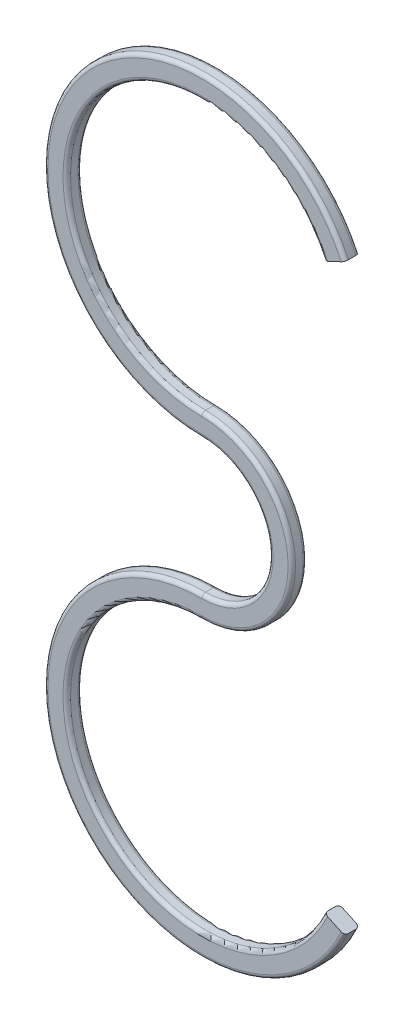
ISO-10303-21;
HEADER;
FILE_DESCRIPTION(('STEP AP214'),'2;1');
FILE_NAME('part.step','',(''),(''),'','','');
FILE_SCHEMA(('AUTOMOTIVE_DESIGN { 1 0 10303 214 1 1 1 1 }'));
ENDSEC;
DATA;
#1=APPLICATION_CONTEXT('core data for automotive mechanical design processes');
#2=APPLICATION_PROTOCOL_DEFINITION('international standard','automotive_design',2000,#1);
#3=PRODUCT_CONTEXT('',#1,'mechanical');
#4=PRODUCT('Part','Part','',(#3));
#5=PRODUCT_RELATED_PRODUCT_CATEGORY('part','',(#4));
#6=PRODUCT_DEFINITION_FORMATION('','',#4);
#7=PRODUCT_DEFINITION_CONTEXT('part definition',#1,'design');
#8=PRODUCT_DEFINITION('design','',#6,#7);
#9=PRODUCT_DEFINITION_SHAPE('','',#8);
#10=(LENGTH_UNIT() NAMED_UNIT(*) SI_UNIT(.MILLI.,.METRE.));
#11=(NAMED_UNIT(*) PLANE_ANGLE_UNIT() SI_UNIT($,.RADIAN.));
#12=(NAMED_UNIT(*) SI_UNIT($,.STERADIAN.) SOLID_ANGLE_UNIT());
#13=UNCERTAINTY_MEASURE_WITH_UNIT(LENGTH_MEASURE(1.E-05),#10,'distance_accuracy_value','');
#14=(GEOMETRIC_REPRESENTATION_CONTEXT(3) GLOBAL_UNCERTAINTY_ASSIGNED_CONTEXT((#13)) GLOBAL_UNIT_ASSIGNED_CONTEXT((#10,
#11,#12)) REPRESENTATION_CONTEXT('',''));
#15=CARTESIAN_POINT('',(0.,0.,0.));
#16=DIRECTION('',(0.,0.,1.));
#17=DIRECTION('',(1.,0.,0.));
#18=AXIS2_PLACEMENT_3D('',#15,#16,#17);
#19=CARTESIAN_POINT('',(0.,15.,1.));
#20=DIRECTION('',(0.,0.,-1.));
#21=DIRECTION('',(-1.,0.,0.));
#22=AXIS2_PLACEMENT_3D('',#19,#20,#21);
#23=CYLINDRICAL_SURFACE('',#22,9.);
#24=DIRECTION('',(0.,0.,-1.));
#25=VECTOR('',#24,1.);
#26=CARTESIAN_POINT('',(8.15677008332986,18.8035643556663,1.));
#27=LINE('',#26,#25);
#28=CARTESIAN_POINT('',(8.15677008332986,18.8035643556663,0.75));
#29=VERTEX_POINT('',#28);
#30=CARTESIAN_POINT('',(8.15677008332986,18.8035643556663,0.25));
#31=VERTEX_POINT('',#30);
#32=EDGE_CURVE('E302',#29,#31,#27,.T.);
#33=ORIENTED_EDGE('',*,*,#32,.F.);
#34=CARTESIAN_POINT('',(0.,15.,0.75));
#35=DIRECTION('',(0.,0.,-1.));
#36=DIRECTION('',(-1.,0.,0.));
#37=AXIS2_PLACEMENT_3D('',#34,#35,#36);
#38=CIRCLE('',#37,9.);
#39=CARTESIAN_POINT('',(0.,6.,0.75));
#40=VERTEX_POINT('',#39);
#41=EDGE_CURVE('E11',#29,#40,#38,.F.);
#42=ORIENTED_EDGE('',*,*,#41,.T.);
#43=DIRECTION('',(0.,0.,-1.));
#44=VECTOR('',#43,1.);
#45=CARTESIAN_POINT('',(0.,6.,1.));
#46=LINE('',#45,#44);
#47=CARTESIAN_POINT('',(0.,6.,0.25));
#48=VERTEX_POINT('',#47);
#49=EDGE_CURVE('E350',#40,#48,#46,.T.);
#50=ORIENTED_EDGE('',*,*,#49,.T.);
#51=CARTESIAN_POINT('',(0.,15.,0.25));
#52=DIRECTION('',(0.,0.,-1.));
#53=DIRECTION('',(-1.,0.,0.));
#54=AXIS2_PLACEMENT_3D('',#51,#52,#53);
#55=CIRCLE('',#54,9.);
#56=EDGE_CURVE('E55',#48,#31,#55,.T.);
#57=ORIENTED_EDGE('',*,*,#56,.T.);
#58=EDGE_LOOP('',(#33,#42,#50,#57));
#59=FACE_BOUND('',#58,.T.);
#60=ADVANCED_FACE('F45',(#59),#23,.F.);
#61=CARTESIAN_POINT('',(9.51623176388483,19.4374917482773,1.));
#62=DIRECTION('',(0.422618261740698,-0.906307787036651,0.));
#63=DIRECTION('',(0.906307787036651,0.422618261740698,0.));
#64=AXIS2_PLACEMENT_3D('',#61,#62,#63);
#65=PLANE('',#64);
#66=DIRECTION('',(-0.906307787036651,-0.422618261740698,0.));
#67=VECTOR('',#66,1.);
#68=CARTESIAN_POINT('',(9.51623176388483,19.4374917482773,0.));
#69=LINE('',#68,#67);
#70=CARTESIAN_POINT('',(9.28965481712567,19.3318371828422,0.));
#71=VERTEX_POINT('',#70);
#72=CARTESIAN_POINT('',(8.38334703008902,18.9092189211015,0.));
#73=VERTEX_POINT('',#72);
#74=EDGE_CURVE('E180',#71,#73,#69,.T.);
#75=ORIENTED_EDGE('',*,*,#74,.F.);
#76=CARTESIAN_POINT('',(9.28965481712567,19.3318371828422,0.25));
#77=DIRECTION('',(0.422618261740698,-0.906307787036651,0.));
#78=DIRECTION('',(0.906307787036651,0.422618261740698,0.));
#79=AXIS2_PLACEMENT_3D('',#76,#77,#78);
#80=CIRCLE('',#79,0.25);
#81=CARTESIAN_POINT('',(9.51623176388483,19.4374917482773,0.25));
#82=VERTEX_POINT('',#81);
#83=EDGE_CURVE('E329',#71,#82,#80,.T.);
#84=ORIENTED_EDGE('',*,*,#83,.T.);
#85=DIRECTION('',(0.,0.,-1.));
#86=VECTOR('',#85,1.);
#87=CARTESIAN_POINT('',(9.51623176388483,19.4374917482773,1.));
#88=LINE('',#87,#86);
#89=CARTESIAN_POINT('',(9.51623176388483,19.4374917482773,0.75));
#90=VERTEX_POINT('',#89);
#91=EDGE_CURVE('E298',#90,#82,#88,.T.);
#92=ORIENTED_EDGE('',*,*,#91,.F.);
#93=CARTESIAN_POINT('',(9.28965481712567,19.3318371828422,0.75));
#94=DIRECTION('',(0.422618261740698,-0.906307787036651,0.));
#95=DIRECTION('',(0.906307787036651,0.422618261740698,0.));
#96=AXIS2_PLACEMENT_3D('',#93,#94,#95);
#97=CIRCLE('',#96,0.25);
#98=CARTESIAN_POINT('',(9.28965481712567,19.3318371828422,1.));
#99=VERTEX_POINT('',#98);
#100=EDGE_CURVE('E326',#90,#99,#97,.T.);
#101=ORIENTED_EDGE('',*,*,#100,.T.);
#102=DIRECTION('',(-0.906307787036651,-0.422618261740698,0.));
#103=VECTOR('',#102,1.);
#104=CARTESIAN_POINT('',(9.51623176388483,19.4374917482773,1.));
#105=LINE('',#104,#103);
#106=CARTESIAN_POINT('',(8.38334703008902,18.9092189211015,1.));
#107=VERTEX_POINT('',#106);
#108=EDGE_CURVE('E179',#99,#107,#105,.T.);
#109=ORIENTED_EDGE('',*,*,#108,.T.);
#110=CARTESIAN_POINT('',(8.38334703008902,18.9092189211015,0.75));
#111=DIRECTION('',(0.422618261740698,-0.906307787036651,0.));
#112=DIRECTION('',(0.906307787036651,0.422618261740698,0.));
#113=AXIS2_PLACEMENT_3D('',#110,#111,#112);
#114=CIRCLE('',#113,0.25);
#115=EDGE_CURVE('E323',#107,#29,#114,.T.);
#116=ORIENTED_EDGE('',*,*,#115,.T.);
#117=ORIENTED_EDGE('',*,*,#32,.T.);
#118=CARTESIAN_POINT('',(8.38334703008902,18.9092189211015,0.25));
#119=DIRECTION('',(0.422618261740698,-0.906307787036651,0.));
#120=DIRECTION('',(0.906307787036651,0.422618261740698,0.));
#121=AXIS2_PLACEMENT_3D('',#118,#119,#120);
#122=CIRCLE('',#121,0.25);
#123=EDGE_CURVE('E320',#31,#73,#122,.T.);
#124=ORIENTED_EDGE('',*,*,#123,.T.);
#125=EDGE_LOOP('',(#75,#84,#92,#101,#109,#116,#117,#124));
#126=FACE_BOUND('',#125,.T.);
#127=ADVANCED_FACE('F393',(#126),#65,.T.);
#128=CARTESIAN_POINT('',(0.,15.,1.));
#129=DIRECTION('',(0.,0.,-1.));
#130=DIRECTION('',(-1.,0.,0.));
#131=AXIS2_PLACEMENT_3D('',#128,#129,#130);
#132=CYLINDRICAL_SURFACE('',#131,10.5);
#133=ORIENTED_EDGE('',*,*,#91,.T.);
#134=CARTESIAN_POINT('',(0.,15.,0.25));
#135=DIRECTION('',(0.,0.,-1.));
#136=DIRECTION('',(-1.,0.,0.));
#137=AXIS2_PLACEMENT_3D('',#134,#135,#136);
#138=CIRCLE('',#137,10.5);
#139=CARTESIAN_POINT('',(0.,4.5,0.25));
#140=VERTEX_POINT('',#139);
#141=EDGE_CURVE('E336',#82,#140,#138,.F.);
#142=ORIENTED_EDGE('',*,*,#141,.T.);
#143=DIRECTION('',(0.,0.,-1.));
#144=VECTOR('',#143,1.);
#145=CARTESIAN_POINT('',(0.,4.5,1.));
#146=LINE('',#145,#144);
#147=CARTESIAN_POINT('',(0.,4.5,0.75));
#148=VERTEX_POINT('',#147);
#149=EDGE_CURVE('E289',#148,#140,#146,.T.);
#150=ORIENTED_EDGE('',*,*,#149,.F.);
#151=CARTESIAN_POINT('',(0.,15.,0.75));
#152=DIRECTION('',(0.,0.,-1.));
#153=DIRECTION('',(-1.,0.,0.));
#154=AXIS2_PLACEMENT_3D('',#151,#152,#153);
#155=CIRCLE('',#154,10.5);
#156=EDGE_CURVE('E332',#148,#90,#155,.T.);
#157=ORIENTED_EDGE('',*,*,#156,.T.);
#158=EDGE_LOOP('',(#133,#142,#150,#157));
#159=FACE_BOUND('',#158,.T.);
#160=ADVANCED_FACE('F398',(#159),#132,.T.);
#161=CARTESIAN_POINT('',(0.,0.,1.));
#162=DIRECTION('',(0.,0.,-1.));
#163=DIRECTION('',(-1.,0.,0.));
#164=AXIS2_PLACEMENT_3D('',#161,#162,#163);
#165=CYLINDRICAL_SURFACE('',#164,4.5);
#166=ORIENTED_EDGE('',*,*,#149,.T.);
#167=CARTESIAN_POINT('',(0.,0.,0.25));
#168=DIRECTION('',(0.,0.,-1.));
#169=DIRECTION('',(-1.,0.,0.));
#170=AXIS2_PLACEMENT_3D('',#167,#168,#169);
#171=CIRCLE('',#170,4.5);
#172=CARTESIAN_POINT('',(0.,-4.5,0.25));
#173=VERTEX_POINT('',#172);
#174=EDGE_CURVE('E341',#140,#173,#171,.T.);
#175=ORIENTED_EDGE('',*,*,#174,.T.);
#176=DIRECTION('',(0.,0.,-1.));
#177=VECTOR('',#176,1.);
#178=CARTESIAN_POINT('',(0.,-4.5,1.));
#179=LINE('',#178,#177);
#180=CARTESIAN_POINT('',(0.,-4.5,0.75));
#181=VERTEX_POINT('',#180);
#182=EDGE_CURVE('E284',#181,#173,#179,.T.);
#183=ORIENTED_EDGE('',*,*,#182,.F.);
#184=CARTESIAN_POINT('',(0.,0.,0.75));
#185=DIRECTION('',(0.,0.,-1.));
#186=DIRECTION('',(-1.,0.,0.));
#187=AXIS2_PLACEMENT_3D('',#184,#185,#186);
#188=CIRCLE('',#187,4.5);
#189=EDGE_CURVE('E236',#181,#148,#188,.F.);
#190=ORIENTED_EDGE('',*,*,#189,.T.);
#191=EDGE_LOOP('',(#166,#175,#183,#190));
#192=FACE_BOUND('',#191,.T.);
#193=ADVANCED_FACE('F405',(#192),#165,.F.);
#194=CARTESIAN_POINT('',(0.,-15.,1.));
#195=DIRECTION('',(0.,0.,-1.));
#196=DIRECTION('',(-1.,0.,0.));
#197=AXIS2_PLACEMENT_3D('',#194,#195,#196);
#198=CYLINDRICAL_SURFACE('',#197,10.5);
#199=ORIENTED_EDGE('',*,*,#182,.T.);
#200=CARTESIAN_POINT('',(0.,-15.,0.25));
#201=DIRECTION('',(0.,0.,-1.));
#202=DIRECTION('',(-1.,0.,0.));
#203=AXIS2_PLACEMENT_3D('',#200,#201,#202);
#204=CIRCLE('',#203,10.5);
#205=CARTESIAN_POINT('',(9.51623176388483,-19.4374917482773,0.25));
#206=VERTEX_POINT('',#205);
#207=EDGE_CURVE('E272',#173,#206,#204,.F.);
#208=ORIENTED_EDGE('',*,*,#207,.T.);
#209=DIRECTION('',(0.,0.,-1.));
#210=VECTOR('',#209,1.);
#211=CARTESIAN_POINT('',(9.51623176388483,-19.4374917482773,1.));
#212=LINE('',#211,#210);
#213=CARTESIAN_POINT('',(9.51623176388483,-19.4374917482773,0.75));
#214=VERTEX_POINT('',#213);
#215=EDGE_CURVE('E276',#214,#206,#212,.T.);
#216=ORIENTED_EDGE('',*,*,#215,.F.);
#217=CARTESIAN_POINT('',(0.,-15.,0.75));
#218=DIRECTION('',(0.,0.,-1.));
#219=DIRECTION('',(-1.,0.,0.));
#220=AXIS2_PLACEMENT_3D('',#217,#218,#219);
#221=CIRCLE('',#220,10.5);
#222=EDGE_CURVE('E241',#214,#181,#221,.T.);
#223=ORIENTED_EDGE('',*,*,#222,.T.);
#224=EDGE_LOOP('',(#199,#208,#216,#223));
#225=FACE_BOUND('',#224,.T.);
#226=ADVANCED_FACE('F280',(#225),#198,.T.);
#227=CARTESIAN_POINT('',(8.15677008332986,-18.8035643556663,1.));
#228=DIRECTION('',(0.422618261740701,0.906307787036649,0.));
#229=DIRECTION('',(-0.906307787036649,0.422618261740701,0.));
#230=AXIS2_PLACEMENT_3D('',#227,#228,#229);
#231=PLANE('',#230);
#232=ORIENTED_EDGE('',*,*,#215,.T.);
#233=CARTESIAN_POINT('',(9.28965481712565,-19.3318371828422,0.25));
#234=DIRECTION('',(0.422618261740701,0.906307787036649,0.));
#235=DIRECTION('',(-0.906307787036649,0.422618261740701,0.));
#236=AXIS2_PLACEMENT_3D('',#233,#234,#235);
#237=CIRCLE('',#236,0.25);
#238=CARTESIAN_POINT('',(9.28965481712567,-19.3318371828422,0.));
#239=VERTEX_POINT('',#238);
#240=EDGE_CURVE('E177',#206,#239,#237,.T.);
#241=ORIENTED_EDGE('',*,*,#240,.T.);
#242=DIRECTION('',(0.906307787036649,-0.422618261740701,0.));
#243=VECTOR('',#242,1.);
#244=CARTESIAN_POINT('',(8.15677008332986,-18.8035643556663,0.));
#245=LINE('',#244,#243);
#246=CARTESIAN_POINT('',(8.38334703008902,-18.9092189211015,0.));
#247=VERTEX_POINT('',#246);
#248=EDGE_CURVE('E164',#247,#239,#245,.T.);
#249=ORIENTED_EDGE('',*,*,#248,.F.);
#250=CARTESIAN_POINT('',(8.38334703008901,-18.9092189211015,0.25));
#251=DIRECTION('',(0.422618261740701,0.906307787036649,0.));
#252=DIRECTION('',(-0.906307787036649,0.422618261740701,0.));
#253=AXIS2_PLACEMENT_3D('',#250,#251,#252);
#254=CIRCLE('',#253,0.25);
#255=CARTESIAN_POINT('',(8.15677008332986,-18.8035643556663,0.25));
#256=VERTEX_POINT('',#255);
#257=EDGE_CURVE('E63',#247,#256,#254,.T.);
#258=ORIENTED_EDGE('',*,*,#257,.T.);
#259=DIRECTION('',(0.,0.,-1.));
#260=VECTOR('',#259,1.);
#261=CARTESIAN_POINT('',(8.15677008332986,-18.8035643556663,1.));
#262=LINE('',#261,#260);
#263=CARTESIAN_POINT('',(8.15677008332986,-18.8035643556663,0.75));
#264=VERTEX_POINT('',#263);
#265=EDGE_CURVE('E285',#264,#256,#262,.T.);
#266=ORIENTED_EDGE('',*,*,#265,.F.);
#267=CARTESIAN_POINT('',(8.38334703008901,-18.9092189211015,0.75));
#268=DIRECTION('',(0.422618261740701,0.906307787036649,0.));
#269=DIRECTION('',(-0.906307787036649,0.422618261740701,0.));
#270=AXIS2_PLACEMENT_3D('',#267,#268,#269);
#271=CIRCLE('',#270,0.25);
#272=CARTESIAN_POINT('',(8.38334703008902,-18.9092189211015,1.));
#273=VERTEX_POINT('',#272);
#274=EDGE_CURVE('E186',#264,#273,#271,.T.);
#275=ORIENTED_EDGE('',*,*,#274,.T.);
#276=DIRECTION('',(0.906307787036649,-0.422618261740701,0.));
#277=VECTOR('',#276,1.);
#278=CARTESIAN_POINT('',(8.15677008332986,-18.8035643556663,1.));
#279=LINE('',#278,#277);
#280=CARTESIAN_POINT('',(9.28965481712567,-19.3318371828422,1.));
#281=VERTEX_POINT('',#280);
#282=EDGE_CURVE('E277',#273,#281,#279,.T.);
#283=ORIENTED_EDGE('',*,*,#282,.T.);
#284=CARTESIAN_POINT('',(9.28965481712565,-19.3318371828422,0.75));
#285=DIRECTION('',(0.422618261740701,0.906307787036649,0.));
#286=DIRECTION('',(-0.906307787036649,0.422618261740701,0.));
#287=AXIS2_PLACEMENT_3D('',#284,#285,#286);
#288=CIRCLE('',#287,0.25);
#289=EDGE_CURVE('E191',#281,#214,#288,.T.);
#290=ORIENTED_EDGE('',*,*,#289,.T.);
#291=EDGE_LOOP('',(#232,#241,#249,#258,#266,#275,#283,#290));
#292=FACE_BOUND('',#291,.T.);
#293=ADVANCED_FACE('F175',(#292),#231,.T.);
#294=CARTESIAN_POINT('',(0.,-15.,1.));
#295=DIRECTION('',(0.,0.,-1.));
#296=DIRECTION('',(-1.,0.,0.));
#297=AXIS2_PLACEMENT_3D('',#294,#295,#296);
#298=CYLINDRICAL_SURFACE('',#297,9.);
#299=ORIENTED_EDGE('',*,*,#265,.T.);
#300=CARTESIAN_POINT('',(0.,-15.,0.25));
#301=DIRECTION('',(0.,0.,-1.));
#302=DIRECTION('',(-1.,0.,0.));
#303=AXIS2_PLACEMENT_3D('',#300,#301,#302);
#304=CIRCLE('',#303,9.);
#305=CARTESIAN_POINT('',(0.,-6.,0.25));
#306=VERTEX_POINT('',#305);
#307=EDGE_CURVE('E184',#256,#306,#304,.T.);
#308=ORIENTED_EDGE('',*,*,#307,.T.);
#309=DIRECTION('',(0.,0.,-1.));
#310=VECTOR('',#309,1.);
#311=CARTESIAN_POINT('',(0.,-6.,1.));
#312=LINE('',#311,#310);
#313=CARTESIAN_POINT('',(0.,-6.,0.75));
#314=VERTEX_POINT('',#313);
#315=EDGE_CURVE('E291',#314,#306,#312,.T.);
#316=ORIENTED_EDGE('',*,*,#315,.F.);
#317=CARTESIAN_POINT('',(0.,-15.,0.75));
#318=DIRECTION('',(0.,0.,-1.));
#319=DIRECTION('',(-1.,0.,0.));
#320=AXIS2_PLACEMENT_3D('',#317,#318,#319);
#321=CIRCLE('',#320,9.);
#322=EDGE_CURVE('E70',#314,#264,#321,.F.);
#323=ORIENTED_EDGE('',*,*,#322,.T.);
#324=EDGE_LOOP('',(#299,#308,#316,#323));
#325=FACE_BOUND('',#324,.T.);
#326=ADVANCED_FACE('F353',(#325),#298,.F.);
#327=CARTESIAN_POINT('',(0.,0.,1.));
#328=DIRECTION('',(0.,0.,-1.));
#329=DIRECTION('',(-1.,0.,0.));
#330=AXIS2_PLACEMENT_3D('',#327,#328,#329);
#331=CYLINDRICAL_SURFACE('',#330,6.);
#332=ORIENTED_EDGE('',*,*,#315,.T.);
#333=CARTESIAN_POINT('',(0.,0.,0.25));
#334=DIRECTION('',(0.,0.,-1.));
#335=DIRECTION('',(-1.,0.,0.));
#336=AXIS2_PLACEMENT_3D('',#333,#334,#335);
#337=CIRCLE('',#336,6.);
#338=EDGE_CURVE('E247',#306,#48,#337,.F.);
#339=ORIENTED_EDGE('',*,*,#338,.T.);
#340=ORIENTED_EDGE('',*,*,#49,.F.);
#341=CARTESIAN_POINT('',(0.,0.,0.75));
#342=DIRECTION('',(0.,0.,-1.));
#343=DIRECTION('',(-1.,0.,0.));
#344=AXIS2_PLACEMENT_3D('',#341,#342,#343);
#345=CIRCLE('',#344,6.);
#346=EDGE_CURVE('E254',#40,#314,#345,.T.);
#347=ORIENTED_EDGE('',*,*,#346,.T.);
#348=EDGE_LOOP('',(#332,#339,#340,#347));
#349=FACE_BOUND('',#348,.T.);
#350=ADVANCED_FACE('F348',(#349),#331,.T.);
#351=CARTESIAN_POINT('',(0.,15.,1.));
#352=DIRECTION('',(0.,0.,-1.));
#353=DIRECTION('',(-1.,0.,0.));
#354=AXIS2_PLACEMENT_3D('',#351,#352,#353);
#355=PLANE('',#354);
#356=CARTESIAN_POINT('',(0.,0.,1.));
#357=DIRECTION('',(0.,0.,-1.));
#358=DIRECTION('',(-1.,0.,0.));
#359=AXIS2_PLACEMENT_3D('',#356,#357,#358);
#360=CIRCLE('',#359,5.75);
#361=CARTESIAN_POINT('',(0.,-5.75,1.));
#362=VERTEX_POINT('',#361);
#363=CARTESIAN_POINT('',(0.,5.75,1.));
#364=VERTEX_POINT('',#363);
#365=EDGE_CURVE('E263',#362,#364,#360,.F.);
#366=ORIENTED_EDGE('',*,*,#365,.T.);
#367=CARTESIAN_POINT('',(0.,15.,1.));
#368=DIRECTION('',(0.,0.,-1.));
#369=DIRECTION('',(-1.,0.,0.));
#370=AXIS2_PLACEMENT_3D('',#367,#368,#369);
#371=CIRCLE('',#370,9.25);
#372=EDGE_CURVE('E267',#364,#107,#371,.T.);
#373=ORIENTED_EDGE('',*,*,#372,.T.);
#374=ORIENTED_EDGE('',*,*,#108,.F.);
#375=CARTESIAN_POINT('',(0.,15.,1.));
#376=DIRECTION('',(0.,0.,-1.));
#377=DIRECTION('',(-1.,0.,0.));
#378=AXIS2_PLACEMENT_3D('',#375,#376,#377);
#379=CIRCLE('',#378,10.25);
#380=CARTESIAN_POINT('',(0.,4.75,1.));
#381=VERTEX_POINT('',#380);
#382=EDGE_CURVE('E251',#99,#381,#379,.F.);
#383=ORIENTED_EDGE('',*,*,#382,.T.);
#384=CARTESIAN_POINT('',(0.,0.,1.));
#385=DIRECTION('',(0.,0.,-1.));
#386=DIRECTION('',(-1.,0.,0.));
#387=AXIS2_PLACEMENT_3D('',#384,#385,#386);
#388=CIRCLE('',#387,4.75);
#389=CARTESIAN_POINT('',(0.,-4.75,1.));
#390=VERTEX_POINT('',#389);
#391=EDGE_CURVE('E235',#381,#390,#388,.T.);
#392=ORIENTED_EDGE('',*,*,#391,.T.);
#393=CARTESIAN_POINT('',(0.,-15.,1.));
#394=DIRECTION('',(0.,0.,-1.));
#395=DIRECTION('',(-1.,0.,0.));
#396=AXIS2_PLACEMENT_3D('',#393,#394,#395);
#397=CIRCLE('',#396,10.25);
#398=EDGE_CURVE('E242',#390,#281,#397,.F.);
#399=ORIENTED_EDGE('',*,*,#398,.T.);
#400=ORIENTED_EDGE('',*,*,#282,.F.);
#401=CARTESIAN_POINT('',(0.,-15.,1.));
#402=DIRECTION('',(0.,0.,-1.));
#403=DIRECTION('',(-1.,0.,0.));
#404=AXIS2_PLACEMENT_3D('',#401,#402,#403);
#405=CIRCLE('',#404,9.25);
#406=EDGE_CURVE('E260',#273,#362,#405,.T.);
#407=ORIENTED_EDGE('',*,*,#406,.T.);
#408=EDGE_LOOP('',(#366,#373,#374,#383,#392,#399,#400,#407));
#409=FACE_BOUND('',#408,.T.);
#410=ADVANCED_FACE('F363',(#409),#355,.F.);
#411=CARTESIAN_POINT('',(0.,15.,0.));
#412=DIRECTION('',(0.,0.,-1.));
#413=DIRECTION('',(-1.,0.,0.));
#414=AXIS2_PLACEMENT_3D('',#411,#412,#413);
#415=PLANE('',#414);
#416=CARTESIAN_POINT('',(0.,0.,0.));
#417=DIRECTION('',(0.,0.,-1.));
#418=DIRECTION('',(-1.,0.,0.));
#419=AXIS2_PLACEMENT_3D('',#416,#417,#418);
#420=CIRCLE('',#419,4.75);
#421=CARTESIAN_POINT('',(0.,-4.75,0.));
#422=VERTEX_POINT('',#421);
#423=CARTESIAN_POINT('',(0.,4.75,0.));
#424=VERTEX_POINT('',#423);
#425=EDGE_CURVE('E313',#422,#424,#420,.F.);
#426=ORIENTED_EDGE('',*,*,#425,.T.);
#427=CARTESIAN_POINT('',(0.,15.,0.));
#428=DIRECTION('',(0.,0.,-1.));
#429=DIRECTION('',(-1.,0.,0.));
#430=AXIS2_PLACEMENT_3D('',#427,#428,#429);
#431=CIRCLE('',#430,10.25);
#432=EDGE_CURVE('E316',#424,#71,#431,.T.);
#433=ORIENTED_EDGE('',*,*,#432,.T.);
#434=ORIENTED_EDGE('',*,*,#74,.T.);
#435=CARTESIAN_POINT('',(0.,15.,0.));
#436=DIRECTION('',(0.,0.,-1.));
#437=DIRECTION('',(-1.,0.,0.));
#438=AXIS2_PLACEMENT_3D('',#435,#436,#437);
#439=CIRCLE('',#438,9.25);
#440=CARTESIAN_POINT('',(0.,5.75,0.));
#441=VERTEX_POINT('',#440);
#442=EDGE_CURVE('E306',#73,#441,#439,.F.);
#443=ORIENTED_EDGE('',*,*,#442,.T.);
#444=CARTESIAN_POINT('',(0.,0.,0.));
#445=DIRECTION('',(0.,0.,-1.));
#446=DIRECTION('',(-1.,0.,0.));
#447=AXIS2_PLACEMENT_3D('',#444,#445,#446);
#448=CIRCLE('',#447,5.75);
#449=CARTESIAN_POINT('',(0.,-5.75,0.));
#450=VERTEX_POINT('',#449);
#451=EDGE_CURVE('E167',#441,#450,#448,.T.);
#452=ORIENTED_EDGE('',*,*,#451,.T.);
#453=CARTESIAN_POINT('',(0.,-15.,0.));
#454=DIRECTION('',(0.,0.,-1.));
#455=DIRECTION('',(-1.,0.,0.));
#456=AXIS2_PLACEMENT_3D('',#453,#454,#455);
#457=CIRCLE('',#456,9.25);
#458=EDGE_CURVE('E162',#450,#247,#457,.F.);
#459=ORIENTED_EDGE('',*,*,#458,.T.);
#460=ORIENTED_EDGE('',*,*,#248,.T.);
#461=CARTESIAN_POINT('',(0.,-15.,0.));
#462=DIRECTION('',(0.,0.,-1.));
#463=DIRECTION('',(-1.,0.,0.));
#464=AXIS2_PLACEMENT_3D('',#461,#462,#463);
#465=CIRCLE('',#464,10.25);
#466=EDGE_CURVE('E172',#239,#422,#465,.T.);
#467=ORIENTED_EDGE('',*,*,#466,.T.);
#468=EDGE_LOOP('',(#426,#433,#434,#443,#452,#459,#460,#467));
#469=FACE_BOUND('',#468,.T.);
#470=ADVANCED_FACE('F163',(#469),#415,.T.);
#471=CARTESIAN_POINT('',(0.,-15.,0.25));
#472=DIRECTION('',(0.,0.,-1.));
#473=DIRECTION('',(-1.,0.,0.));
#474=AXIS2_PLACEMENT_3D('',#471,#472,#473);
#475=TOROIDAL_SURFACE('',#474,10.25,0.25);
#476=ORIENTED_EDGE('',*,*,#240,.F.);
#477=ORIENTED_EDGE('',*,*,#207,.F.);
#478=CARTESIAN_POINT('',(0.,-4.75,0.25));
#479=DIRECTION('',(1.,0.,0.));
#480=DIRECTION('',(0.,1.,0.));
#481=AXIS2_PLACEMENT_3D('',#478,#479,#480);
#482=CIRCLE('',#481,0.25);
#483=EDGE_CURVE('E205',#422,#173,#482,.T.);
#484=ORIENTED_EDGE('',*,*,#483,.F.);
#485=ORIENTED_EDGE('',*,*,#466,.F.);
#486=EDGE_LOOP('',(#476,#477,#484,#485));
#487=FACE_BOUND('',#486,.T.);
#488=ADVANCED_FACE('F411',(#487),#475,.T.);
#489=CARTESIAN_POINT('',(0.,0.,0.25));
#490=DIRECTION('',(0.,0.,-1.));
#491=DIRECTION('',(-1.,0.,0.));
#492=AXIS2_PLACEMENT_3D('',#489,#490,#491);
#493=TOROIDAL_SURFACE('',#492,4.75,0.25);
#494=ORIENTED_EDGE('',*,*,#483,.T.);
#495=ORIENTED_EDGE('',*,*,#174,.F.);
#496=CARTESIAN_POINT('',(0.,4.75,0.25));
#497=DIRECTION('',(-1.,0.,0.));
#498=DIRECTION('',(0.,-1.,0.));
#499=AXIS2_PLACEMENT_3D('',#496,#497,#498);
#500=CIRCLE('',#499,0.25);
#501=EDGE_CURVE('E201',#424,#140,#500,.T.);
#502=ORIENTED_EDGE('',*,*,#501,.F.);
#503=ORIENTED_EDGE('',*,*,#425,.F.);
#504=EDGE_LOOP('',(#494,#495,#502,#503));
#505=FACE_BOUND('',#504,.T.);
#506=ADVANCED_FACE('F407',(#505),#493,.T.);
#507=CARTESIAN_POINT('',(0.,15.,0.25));
#508=DIRECTION('',(0.,0.,-1.));
#509=DIRECTION('',(-1.,0.,0.));
#510=AXIS2_PLACEMENT_3D('',#507,#508,#509);
#511=TOROIDAL_SURFACE('',#510,10.25,0.25);
#512=ORIENTED_EDGE('',*,*,#501,.T.);
#513=ORIENTED_EDGE('',*,*,#141,.F.);
#514=ORIENTED_EDGE('',*,*,#83,.F.);
#515=ORIENTED_EDGE('',*,*,#432,.F.);
#516=EDGE_LOOP('',(#512,#513,#514,#515));
#517=FACE_BOUND('',#516,.T.);
#518=ADVANCED_FACE('F401',(#517),#511,.T.);
#519=CARTESIAN_POINT('',(0.,-15.,0.25));
#520=DIRECTION('',(0.,0.,-1.));
#521=DIRECTION('',(-1.,0.,0.));
#522=AXIS2_PLACEMENT_3D('',#519,#520,#521);
#523=TOROIDAL_SURFACE('',#522,9.25,0.25);
#524=ORIENTED_EDGE('',*,*,#257,.F.);
#525=ORIENTED_EDGE('',*,*,#458,.F.);
#526=CARTESIAN_POINT('',(0.,-5.75,0.25));
#527=DIRECTION('',(1.,0.,0.));
#528=DIRECTION('',(0.,0.,-1.));
#529=AXIS2_PLACEMENT_3D('',#526,#527,#528);
#530=CIRCLE('',#529,0.25);
#531=EDGE_CURVE('E206',#306,#450,#530,.T.);
#532=ORIENTED_EDGE('',*,*,#531,.F.);
#533=ORIENTED_EDGE('',*,*,#307,.F.);
#534=EDGE_LOOP('',(#524,#525,#532,#533));
#535=FACE_BOUND('',#534,.T.);
#536=ADVANCED_FACE('F183',(#535),#523,.T.);
#537=CARTESIAN_POINT('',(0.,15.,0.25));
#538=DIRECTION('',(0.,0.,-1.));
#539=DIRECTION('',(-1.,0.,0.));
#540=AXIS2_PLACEMENT_3D('',#537,#538,#539);
#541=TOROIDAL_SURFACE('',#540,9.25,0.25);
#542=ORIENTED_EDGE('',*,*,#123,.F.);
#543=ORIENTED_EDGE('',*,*,#56,.F.);
#544=CARTESIAN_POINT('',(0.,5.75,0.25));
#545=DIRECTION('',(1.,0.,0.));
#546=DIRECTION('',(0.,1.,0.));
#547=AXIS2_PLACEMENT_3D('',#544,#545,#546);
#548=CIRCLE('',#547,0.25);
#549=EDGE_CURVE('E210',#441,#48,#548,.T.);
#550=ORIENTED_EDGE('',*,*,#549,.F.);
#551=ORIENTED_EDGE('',*,*,#442,.F.);
#552=EDGE_LOOP('',(#542,#543,#550,#551));
#553=FACE_BOUND('',#552,.T.);
#554=ADVANCED_FACE('F382',(#553),#541,.T.);
#555=CARTESIAN_POINT('',(0.,0.,0.25));
#556=DIRECTION('',(0.,0.,-1.));
#557=DIRECTION('',(-1.,0.,0.));
#558=AXIS2_PLACEMENT_3D('',#555,#556,#557);
#559=TOROIDAL_SURFACE('',#558,5.75,0.25);
#560=ORIENTED_EDGE('',*,*,#531,.T.);
#561=ORIENTED_EDGE('',*,*,#451,.F.);
#562=ORIENTED_EDGE('',*,*,#549,.T.);
#563=ORIENTED_EDGE('',*,*,#338,.F.);
#564=EDGE_LOOP('',(#560,#561,#562,#563));
#565=FACE_BOUND('',#564,.T.);
#566=ADVANCED_FACE('F386',(#565),#559,.T.);
#567=CARTESIAN_POINT('',(0.,-15.,0.75));
#568=DIRECTION('',(0.,0.,-1.));
#569=DIRECTION('',(-1.,0.,0.));
#570=AXIS2_PLACEMENT_3D('',#567,#568,#569);
#571=TOROIDAL_SURFACE('',#570,9.25,0.25);
#572=ORIENTED_EDGE('',*,*,#274,.F.);
#573=ORIENTED_EDGE('',*,*,#322,.F.);
#574=CARTESIAN_POINT('',(0.,-5.75,0.75));
#575=DIRECTION('',(1.,0.,0.));
#576=DIRECTION('',(0.,1.,0.));
#577=AXIS2_PLACEMENT_3D('',#574,#575,#576);
#578=CIRCLE('',#577,0.25);
#579=EDGE_CURVE('E213',#362,#314,#578,.T.);
#580=ORIENTED_EDGE('',*,*,#579,.F.);
#581=ORIENTED_EDGE('',*,*,#406,.F.);
#582=EDGE_LOOP('',(#572,#573,#580,#581));
#583=FACE_BOUND('',#582,.T.);
#584=ADVANCED_FACE('F358',(#583),#571,.T.);
#585=CARTESIAN_POINT('',(0.,15.,0.75));
#586=DIRECTION('',(0.,0.,-1.));
#587=DIRECTION('',(-1.,0.,0.));
#588=AXIS2_PLACEMENT_3D('',#585,#586,#587);
#589=TOROIDAL_SURFACE('',#588,9.25,0.25);
#590=ORIENTED_EDGE('',*,*,#115,.F.);
#591=ORIENTED_EDGE('',*,*,#372,.F.);
#592=CARTESIAN_POINT('',(0.,5.75,0.75));
#593=DIRECTION('',(1.,0.,0.));
#594=DIRECTION('',(0.,0.,-1.));
#595=AXIS2_PLACEMENT_3D('',#592,#593,#594);
#596=CIRCLE('',#595,0.25);
#597=EDGE_CURVE('E216',#40,#364,#596,.T.);
#598=ORIENTED_EDGE('',*,*,#597,.F.);
#599=ORIENTED_EDGE('',*,*,#41,.F.);
#600=EDGE_LOOP('',(#590,#591,#598,#599));
#601=FACE_BOUND('',#600,.T.);
#602=ADVANCED_FACE('F392',(#601),#589,.T.);
#603=CARTESIAN_POINT('',(0.,0.,0.75));
#604=DIRECTION('',(0.,0.,-1.));
#605=DIRECTION('',(-1.,0.,0.));
#606=AXIS2_PLACEMENT_3D('',#603,#604,#605);
#607=TOROIDAL_SURFACE('',#606,5.75,0.25);
#608=ORIENTED_EDGE('',*,*,#579,.T.);
#609=ORIENTED_EDGE('',*,*,#346,.F.);
#610=ORIENTED_EDGE('',*,*,#597,.T.);
#611=ORIENTED_EDGE('',*,*,#365,.F.);
#612=EDGE_LOOP('',(#608,#609,#610,#611));
#613=FACE_BOUND('',#612,.T.);
#614=ADVANCED_FACE('F361',(#613),#607,.T.);
#615=CARTESIAN_POINT('',(0.,-15.,0.75));
#616=DIRECTION('',(0.,0.,-1.));
#617=DIRECTION('',(-1.,0.,0.));
#618=AXIS2_PLACEMENT_3D('',#615,#616,#617);
#619=TOROIDAL_SURFACE('',#618,10.25,0.25);
#620=ORIENTED_EDGE('',*,*,#289,.F.);
#621=ORIENTED_EDGE('',*,*,#398,.F.);
#622=CARTESIAN_POINT('',(0.,-4.75,0.75));
#623=DIRECTION('',(1.,0.,0.));
#624=DIRECTION('',(0.,0.,-1.));
#625=AXIS2_PLACEMENT_3D('',#622,#623,#624);
#626=CIRCLE('',#625,0.25);
#627=EDGE_CURVE('E49',#181,#390,#626,.T.);
#628=ORIENTED_EDGE('',*,*,#627,.F.);
#629=ORIENTED_EDGE('',*,*,#222,.F.);
#630=EDGE_LOOP('',(#620,#621,#628,#629));
#631=FACE_BOUND('',#630,.T.);
#632=ADVANCED_FACE('F47',(#631),#619,.T.);
#633=CARTESIAN_POINT('',(0.,0.,0.75));
#634=DIRECTION('',(0.,0.,-1.));
#635=DIRECTION('',(-1.,0.,0.));
#636=AXIS2_PLACEMENT_3D('',#633,#634,#635);
#637=TOROIDAL_SURFACE('',#636,4.75,0.25);
#638=ORIENTED_EDGE('',*,*,#627,.T.);
#639=ORIENTED_EDGE('',*,*,#391,.F.);
#640=CARTESIAN_POINT('',(0.,4.75,0.75));
#641=DIRECTION('',(-1.,0.,0.));
#642=DIRECTION('',(0.,0.,1.));
#643=AXIS2_PLACEMENT_3D('',#640,#641,#642);
#644=CIRCLE('',#643,0.25);
#645=EDGE_CURVE('E221',#148,#381,#644,.T.);
#646=ORIENTED_EDGE('',*,*,#645,.F.);
#647=ORIENTED_EDGE('',*,*,#189,.F.);
#648=EDGE_LOOP('',(#638,#639,#646,#647));
#649=FACE_BOUND('',#648,.T.);
#650=ADVANCED_FACE('F234',(#649),#637,.T.);
#651=CARTESIAN_POINT('',(0.,15.,0.75));
#652=DIRECTION('',(0.,0.,-1.));
#653=DIRECTION('',(-1.,0.,0.));
#654=AXIS2_PLACEMENT_3D('',#651,#652,#653);
#655=TOROIDAL_SURFACE('',#654,10.25,0.25);
#656=ORIENTED_EDGE('',*,*,#645,.T.);
#657=ORIENTED_EDGE('',*,*,#382,.F.);
#658=ORIENTED_EDGE('',*,*,#100,.F.);
#659=ORIENTED_EDGE('',*,*,#156,.F.);
#660=EDGE_LOOP('',(#656,#657,#658,#659));
#661=FACE_BOUND('',#660,.T.);
#662=ADVANCED_FACE('F395',(#661),#655,.T.);
#663=CLOSED_SHELL('',(#60,#127,#160,#193,#226,#293,#326,#350,#410,#470,#488,#506,#518,#536,#554,
#566,#584,#602,#614,#632,#650,#662));
#664=MANIFOLD_SOLID_BREP('B2',#663);
#665=ADVANCED_BREP_SHAPE_REPRESENTATION('',(#18,#664),#14);
#666=SHAPE_DEFINITION_REPRESENTATION(#9,#665);
ENDSEC;
END-ISO-10303-21;
